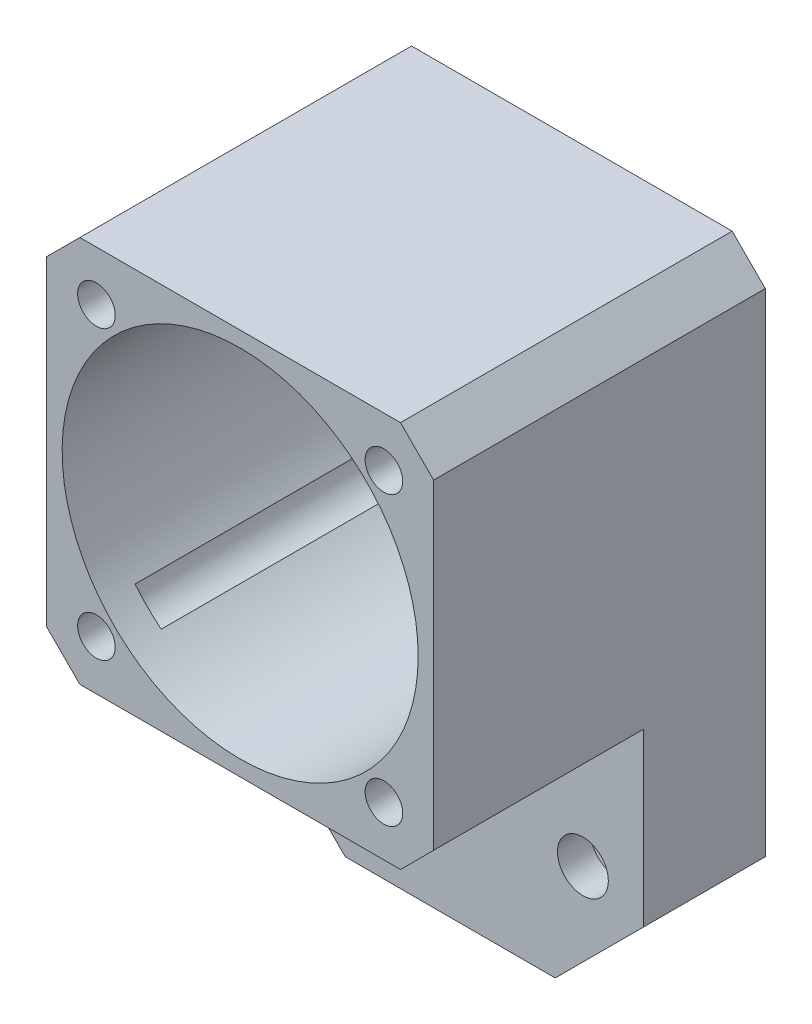
ISO-10303-21;
HEADER;
FILE_DESCRIPTION(('STEP AP214'),'2;1');
FILE_NAME('part.step','',(''),(''),'','','');
FILE_SCHEMA(('AUTOMOTIVE_DESIGN { 1 0 10303 214 1 1 1 1 }'));
ENDSEC;
DATA;
#1=APPLICATION_CONTEXT('core data for automotive mechanical design processes');
#2=APPLICATION_PROTOCOL_DEFINITION('international standard','automotive_design',2000,#1);
#3=PRODUCT_CONTEXT('',#1,'mechanical');
#4=PRODUCT('Part','Part','',(#3));
#5=PRODUCT_RELATED_PRODUCT_CATEGORY('part','',(#4));
#6=PRODUCT_DEFINITION_FORMATION('','',#4);
#7=PRODUCT_DEFINITION_CONTEXT('part definition',#1,'design');
#8=PRODUCT_DEFINITION('design','',#6,#7);
#9=PRODUCT_DEFINITION_SHAPE('','',#8);
#10=(LENGTH_UNIT() NAMED_UNIT(*) SI_UNIT(.MILLI.,.METRE.));
#11=(NAMED_UNIT(*) PLANE_ANGLE_UNIT() SI_UNIT($,.RADIAN.));
#12=(NAMED_UNIT(*) SI_UNIT($,.STERADIAN.) SOLID_ANGLE_UNIT());
#13=UNCERTAINTY_MEASURE_WITH_UNIT(LENGTH_MEASURE(1.E-05),#10,'distance_accuracy_value','');
#14=(GEOMETRIC_REPRESENTATION_CONTEXT(3) GLOBAL_UNCERTAINTY_ASSIGNED_CONTEXT((#13)) GLOBAL_UNIT_ASSIGNED_CONTEXT((#10,
#11,#12)) REPRESENTATION_CONTEXT('',''));
#15=CARTESIAN_POINT('',(0.,0.,0.));
#16=DIRECTION('',(0.,0.,1.));
#17=DIRECTION('',(1.,0.,0.));
#18=AXIS2_PLACEMENT_3D('',#15,#16,#17);
#19=CARTESIAN_POINT('',(0.,0.,11.));
#20=DIRECTION('',(0.,0.,-1.));
#21=DIRECTION('',(-1.,0.,0.));
#22=AXIS2_PLACEMENT_3D('',#19,#20,#21);
#23=CYLINDRICAL_SURFACE('',#22,16.1);
#24=CARTESIAN_POINT('',(0.,0.,30.));
#25=DIRECTION('',(0.,0.,1.));
#26=DIRECTION('',(1.,0.,0.));
#27=AXIS2_PLACEMENT_3D('',#24,#25,#26);
#28=CIRCLE('',#27,16.1);
#29=CARTESIAN_POINT('',(16.1,0.,30.));
#30=VERTEX_POINT('',#29);
#31=EDGE_CURVE('E253',#30,#30,#28,.T.);
#32=ORIENTED_EDGE('',*,*,#31,.T.);
#33=EDGE_LOOP('',(#32));
#34=FACE_BOUND('',#33,.T.);
#35=CARTESIAN_POINT('',(0.,0.,27.));
#36=DIRECTION('',(0.,0.,1.));
#37=DIRECTION('',(1.,0.,0.));
#38=AXIS2_PLACEMENT_3D('',#35,#36,#37);
#39=CIRCLE('',#38,16.1);
#40=CARTESIAN_POINT('',(12.5033010518266,10.1428527943273,27.));
#41=VERTEX_POINT('',#40);
#42=CARTESIAN_POINT('',(10.1428527943273,12.5033010518266,27.));
#43=VERTEX_POINT('',#42);
#44=EDGE_CURVE('E200',#41,#43,#39,.T.);
#45=ORIENTED_EDGE('',*,*,#44,.F.);
#46=DIRECTION('',(0.,0.,-1.));
#47=VECTOR('',#46,1.);
#48=CARTESIAN_POINT('',(12.5033010518266,10.1428527943273,13.5));
#49=LINE('',#48,#47);
#50=CARTESIAN_POINT('',(12.5033010518266,10.1428527943273,0.));
#51=VERTEX_POINT('',#50);
#52=EDGE_CURVE('E216',#41,#51,#49,.T.);
#53=ORIENTED_EDGE('',*,*,#52,.T.);
#54=CARTESIAN_POINT('',(0.,0.,0.));
#55=DIRECTION('',(0.,0.,1.));
#56=DIRECTION('',(1.,0.,0.));
#57=AXIS2_PLACEMENT_3D('',#54,#55,#56);
#58=CIRCLE('',#57,16.1);
#59=CARTESIAN_POINT('',(12.5033010518266,-10.1428527943273,0.));
#60=VERTEX_POINT('',#59);
#61=EDGE_CURVE('E199',#60,#51,#58,.T.);
#62=ORIENTED_EDGE('',*,*,#61,.F.);
#63=DIRECTION('',(0.,0.,-1.));
#64=VECTOR('',#63,1.);
#65=CARTESIAN_POINT('',(12.5033010518266,-10.1428527943273,13.5));
#66=LINE('',#65,#64);
#67=CARTESIAN_POINT('',(12.5033010518266,-10.1428527943273,27.));
#68=VERTEX_POINT('',#67);
#69=EDGE_CURVE('E189',#60,#68,#66,.F.);
#70=ORIENTED_EDGE('',*,*,#69,.T.);
#71=CARTESIAN_POINT('',(0.,0.,27.));
#72=DIRECTION('',(0.,0.,1.));
#73=DIRECTION('',(1.,0.,0.));
#74=AXIS2_PLACEMENT_3D('',#71,#72,#73);
#75=CIRCLE('',#74,16.1);
#76=CARTESIAN_POINT('',(10.1428527943273,-12.5033010518266,27.));
#77=VERTEX_POINT('',#76);
#78=EDGE_CURVE('E176',#77,#68,#75,.T.);
#79=ORIENTED_EDGE('',*,*,#78,.F.);
#80=DIRECTION('',(0.,0.,-1.));
#81=VECTOR('',#80,1.);
#82=CARTESIAN_POINT('',(10.1428527943273,-12.5033010518266,13.5));
#83=LINE('',#82,#81);
#84=CARTESIAN_POINT('',(10.1428527943273,-12.5033010518266,0.));
#85=VERTEX_POINT('',#84);
#86=EDGE_CURVE('E191',#77,#85,#83,.T.);
#87=ORIENTED_EDGE('',*,*,#86,.T.);
#88=CARTESIAN_POINT('',(-10.1428527943273,-12.5033010518266,0.));
#89=VERTEX_POINT('',#88);
#90=EDGE_CURVE('E282',#89,#85,#58,.T.);
#91=ORIENTED_EDGE('',*,*,#90,.F.);
#92=DIRECTION('',(0.,0.,-1.));
#93=VECTOR('',#92,1.);
#94=CARTESIAN_POINT('',(-10.1428527943273,-12.5033010518266,13.5));
#95=LINE('',#94,#93);
#96=CARTESIAN_POINT('',(-10.1428527943273,-12.5033010518266,27.));
#97=VERTEX_POINT('',#96);
#98=EDGE_CURVE('E202',#89,#97,#95,.F.);
#99=ORIENTED_EDGE('',*,*,#98,.T.);
#100=CARTESIAN_POINT('',(0.,0.,27.));
#101=DIRECTION('',(0.,0.,1.));
#102=DIRECTION('',(1.,0.,0.));
#103=AXIS2_PLACEMENT_3D('',#100,#101,#102);
#104=CIRCLE('',#103,16.1);
#105=CARTESIAN_POINT('',(-12.5033010518266,-10.1428527943273,27.));
#106=VERTEX_POINT('',#105);
#107=EDGE_CURVE('E316',#106,#97,#104,.T.);
#108=ORIENTED_EDGE('',*,*,#107,.F.);
#109=DIRECTION('',(0.,0.,-1.));
#110=VECTOR('',#109,1.);
#111=CARTESIAN_POINT('',(-12.5033010518266,-10.1428527943273,13.5));
#112=LINE('',#111,#110);
#113=CARTESIAN_POINT('',(-12.5033010518266,-10.1428527943273,0.));
#114=VERTEX_POINT('',#113);
#115=EDGE_CURVE('E210',#106,#114,#112,.T.);
#116=ORIENTED_EDGE('',*,*,#115,.T.);
#117=CARTESIAN_POINT('',(-12.5033010518266,10.1428527943273,0.));
#118=VERTEX_POINT('',#117);
#119=EDGE_CURVE('E278',#118,#114,#58,.T.);
#120=ORIENTED_EDGE('',*,*,#119,.F.);
#121=DIRECTION('',(0.,0.,-1.));
#122=VECTOR('',#121,1.);
#123=CARTESIAN_POINT('',(-12.5033010518266,10.1428527943273,13.5));
#124=LINE('',#123,#122);
#125=CARTESIAN_POINT('',(-12.5033010518266,10.1428527943273,27.));
#126=VERTEX_POINT('',#125);
#127=EDGE_CURVE('E290',#118,#126,#124,.F.);
#128=ORIENTED_EDGE('',*,*,#127,.T.);
#129=CARTESIAN_POINT('',(0.,0.,27.));
#130=DIRECTION('',(0.,0.,1.));
#131=DIRECTION('',(1.,0.,0.));
#132=AXIS2_PLACEMENT_3D('',#129,#130,#131);
#133=CIRCLE('',#132,16.1);
#134=CARTESIAN_POINT('',(-10.1428527943273,12.5033010518266,27.));
#135=VERTEX_POINT('',#134);
#136=EDGE_CURVE('E225',#135,#126,#133,.T.);
#137=ORIENTED_EDGE('',*,*,#136,.F.);
#138=DIRECTION('',(0.,0.,-1.));
#139=VECTOR('',#138,1.);
#140=CARTESIAN_POINT('',(-10.1428527943273,12.5033010518266,13.5));
#141=LINE('',#140,#139);
#142=CARTESIAN_POINT('',(-10.1428527943273,12.5033010518266,0.));
#143=VERTEX_POINT('',#142);
#144=EDGE_CURVE('E307',#135,#143,#141,.T.);
#145=ORIENTED_EDGE('',*,*,#144,.T.);
#146=CARTESIAN_POINT('',(10.1428527943273,12.5033010518266,0.));
#147=VERTEX_POINT('',#146);
#148=EDGE_CURVE('E277',#147,#143,#58,.T.);
#149=ORIENTED_EDGE('',*,*,#148,.F.);
#150=DIRECTION('',(0.,0.,-1.));
#151=VECTOR('',#150,1.);
#152=CARTESIAN_POINT('',(10.1428527943273,12.5033010518266,13.5));
#153=LINE('',#152,#151);
#154=EDGE_CURVE('E213',#147,#43,#153,.F.);
#155=ORIENTED_EDGE('',*,*,#154,.T.);
#156=EDGE_LOOP('',(#45,#53,#62,#70,#79,#87,#91,#99,#108,#116,#120,#128,#137,#145,#149,#155));
#157=FACE_BOUND('',#156,.T.);
#158=ADVANCED_FACE('F37',(#34,#157),#23,.F.);
#159=CARTESIAN_POINT('',(0.,0.,11.));
#160=DIRECTION('',(0.,0.,1.));
#161=DIRECTION('',(1.,0.,0.));
#162=AXIS2_PLACEMENT_3D('',#159,#160,#161);
#163=PLANE('',#162);
#164=DIRECTION('',(0.,-1.,0.));
#165=VECTOR('',#164,1.);
#166=CARTESIAN_POINT('',(-17.5,17.5,11.));
#167=LINE('',#166,#165);
#168=CARTESIAN_POINT('',(-17.5,-14.5,11.));
#169=VERTEX_POINT('',#168);
#170=CARTESIAN_POINT('',(-17.5,-30.,11.));
#171=VERTEX_POINT('',#170);
#172=EDGE_CURVE('E283',#169,#171,#167,.T.);
#173=ORIENTED_EDGE('',*,*,#172,.T.);
#174=DIRECTION('',(-0.707106781186546,0.707106781186549,0.));
#175=VECTOR('',#174,1.);
#176=CARTESIAN_POINT('',(-23.75,-23.7499999999999,11.));
#177=LINE('',#176,#175);
#178=CARTESIAN_POINT('',(-9.5,-38.,11.));
#179=VERTEX_POINT('',#178);
#180=EDGE_CURVE('E45',#171,#179,#177,.F.);
#181=ORIENTED_EDGE('',*,*,#180,.T.);
#182=DIRECTION('',(1.,0.,0.));
#183=VECTOR('',#182,1.);
#184=CARTESIAN_POINT('',(-17.5,-38.,11.));
#185=LINE('',#184,#183);
#186=CARTESIAN_POINT('',(9.49999999999998,-38.,11.));
#187=VERTEX_POINT('',#186);
#188=EDGE_CURVE('E285',#179,#187,#185,.T.);
#189=ORIENTED_EDGE('',*,*,#188,.T.);
#190=DIRECTION('',(-0.707106781186549,-0.707106781186546,0.));
#191=VECTOR('',#190,1.);
#192=CARTESIAN_POINT('',(23.75,-23.7500000000001,11.));
#193=LINE('',#192,#191);
#194=CARTESIAN_POINT('',(17.5,-30.,11.));
#195=VERTEX_POINT('',#194);
#196=EDGE_CURVE('E52',#187,#195,#193,.F.);
#197=ORIENTED_EDGE('',*,*,#196,.T.);
#198=DIRECTION('',(0.,1.,0.));
#199=VECTOR('',#198,1.);
#200=CARTESIAN_POINT('',(17.5,17.5,11.));
#201=LINE('',#200,#199);
#202=CARTESIAN_POINT('',(17.5,-14.5,11.));
#203=VERTEX_POINT('',#202);
#204=EDGE_CURVE('E288',#195,#203,#201,.T.);
#205=ORIENTED_EDGE('',*,*,#204,.T.);
#206=DIRECTION('',(0.707106781186549,0.707106781186546,0.));
#207=VECTOR('',#206,1.);
#208=CARTESIAN_POINT('',(17.5,-14.5,11.));
#209=LINE('',#208,#207);
#210=CARTESIAN_POINT('',(14.5,-17.5,11.));
#211=VERTEX_POINT('',#210);
#212=EDGE_CURVE('E354',#203,#211,#209,.F.);
#213=ORIENTED_EDGE('',*,*,#212,.T.);
#214=DIRECTION('',(1.,0.,0.));
#215=VECTOR('',#214,1.);
#216=CARTESIAN_POINT('',(-17.5,-17.5,11.));
#217=LINE('',#216,#215);
#218=CARTESIAN_POINT('',(-14.5,-17.5,11.));
#219=VERTEX_POINT('',#218);
#220=EDGE_CURVE('E256',#219,#211,#217,.T.);
#221=ORIENTED_EDGE('',*,*,#220,.F.);
#222=DIRECTION('',(0.707106781186546,-0.707106781186549,0.));
#223=VECTOR('',#222,1.);
#224=CARTESIAN_POINT('',(-14.5,-17.5,11.));
#225=LINE('',#224,#223);
#226=EDGE_CURVE('E351',#219,#169,#225,.F.);
#227=ORIENTED_EDGE('',*,*,#226,.T.);
#228=EDGE_LOOP('',(#173,#181,#189,#197,#205,#213,#221,#227));
#229=FACE_BOUND('',#228,.T.);
#230=CARTESIAN_POINT('',(-12.,-28.,11.));
#231=DIRECTION('',(0.,0.,1.));
#232=DIRECTION('',(1.,0.,0.));
#233=AXIS2_PLACEMENT_3D('',#230,#231,#232);
#234=CIRCLE('',#233,2.3);
#235=CARTESIAN_POINT('',(-9.7,-28.,11.));
#236=VERTEX_POINT('',#235);
#237=EDGE_CURVE('E274',#236,#236,#234,.T.);
#238=ORIENTED_EDGE('',*,*,#237,.F.);
#239=EDGE_LOOP('',(#238));
#240=FACE_BOUND('',#239,.T.);
#241=CARTESIAN_POINT('',(12.,-28.,11.));
#242=DIRECTION('',(0.,0.,1.));
#243=DIRECTION('',(1.,0.,0.));
#244=AXIS2_PLACEMENT_3D('',#241,#242,#243);
#245=CIRCLE('',#244,2.3);
#246=CARTESIAN_POINT('',(14.3,-28.,11.));
#247=VERTEX_POINT('',#246);
#248=EDGE_CURVE('E269',#247,#247,#245,.T.);
#249=ORIENTED_EDGE('',*,*,#248,.F.);
#250=EDGE_LOOP('',(#249));
#251=FACE_BOUND('',#250,.T.);
#252=ADVANCED_FACE('F368',(#229,#240,#251),#163,.T.);
#253=CARTESIAN_POINT('',(0.,0.,0.));
#254=DIRECTION('',(0.,0.,1.));
#255=DIRECTION('',(1.,0.,0.));
#256=AXIS2_PLACEMENT_3D('',#253,#254,#255);
#257=PLANE('',#256);
#258=CARTESIAN_POINT('',(13.,13.,0.));
#259=DIRECTION('',(0.,0.,1.));
#260=DIRECTION('',(1.,0.,0.));
#261=AXIS2_PLACEMENT_3D('',#258,#259,#260);
#262=CIRCLE('',#261,2.9);
#263=EDGE_CURVE('E760',#51,#147,#262,.T.);
#264=ORIENTED_EDGE('',*,*,#263,.T.);
#265=ORIENTED_EDGE('',*,*,#148,.T.);
#266=CARTESIAN_POINT('',(-13.,13.,0.));
#267=DIRECTION('',(0.,0.,1.));
#268=DIRECTION('',(1.,0.,0.));
#269=AXIS2_PLACEMENT_3D('',#266,#267,#268);
#270=CIRCLE('',#269,2.9);
#271=EDGE_CURVE('E218',#143,#118,#270,.T.);
#272=ORIENTED_EDGE('',*,*,#271,.T.);
#273=ORIENTED_EDGE('',*,*,#119,.T.);
#274=CARTESIAN_POINT('',(-13.,-13.,0.));
#275=DIRECTION('',(0.,0.,1.));
#276=DIRECTION('',(1.,0.,0.));
#277=AXIS2_PLACEMENT_3D('',#274,#275,#276);
#278=CIRCLE('',#277,2.9);
#279=EDGE_CURVE('E192',#114,#89,#278,.T.);
#280=ORIENTED_EDGE('',*,*,#279,.T.);
#281=ORIENTED_EDGE('',*,*,#90,.T.);
#282=CARTESIAN_POINT('',(13.,-13.,0.));
#283=DIRECTION('',(0.,0.,1.));
#284=DIRECTION('',(1.,0.,0.));
#285=AXIS2_PLACEMENT_3D('',#282,#283,#284);
#286=CIRCLE('',#285,2.9);
#287=EDGE_CURVE('E193',#85,#60,#286,.T.);
#288=ORIENTED_EDGE('',*,*,#287,.T.);
#289=ORIENTED_EDGE('',*,*,#61,.T.);
#290=EDGE_LOOP('',(#264,#265,#272,#273,#280,#281,#288,#289));
#291=FACE_BOUND('',#290,.T.);
#292=CARTESIAN_POINT('',(12.,-28.,0.));
#293=DIRECTION('',(0.,0.,1.));
#294=DIRECTION('',(1.,0.,0.));
#295=AXIS2_PLACEMENT_3D('',#292,#293,#294);
#296=CIRCLE('',#295,4.);
#297=CARTESIAN_POINT('',(16.,-28.,0.));
#298=VERTEX_POINT('',#297);
#299=EDGE_CURVE('E227',#298,#298,#296,.T.);
#300=ORIENTED_EDGE('',*,*,#299,.T.);
#301=EDGE_LOOP('',(#300));
#302=FACE_BOUND('',#301,.T.);
#303=CARTESIAN_POINT('',(-12.,-28.,0.));
#304=DIRECTION('',(0.,0.,1.));
#305=DIRECTION('',(1.,0.,0.));
#306=AXIS2_PLACEMENT_3D('',#303,#304,#305);
#307=CIRCLE('',#306,4.);
#308=CARTESIAN_POINT('',(-8.,-28.,0.));
#309=VERTEX_POINT('',#308);
#310=EDGE_CURVE('E234',#309,#309,#307,.T.);
#311=ORIENTED_EDGE('',*,*,#310,.T.);
#312=EDGE_LOOP('',(#311));
#313=FACE_BOUND('',#312,.T.);
#314=DIRECTION('',(1.,0.,0.));
#315=VECTOR('',#314,1.);
#316=CARTESIAN_POINT('',(-17.5,-38.,0.));
#317=LINE('',#316,#315);
#318=CARTESIAN_POINT('',(-9.5,-38.,0.));
#319=VERTEX_POINT('',#318);
#320=CARTESIAN_POINT('',(9.49999999999998,-38.,0.));
#321=VERTEX_POINT('',#320);
#322=EDGE_CURVE('E292',#319,#321,#317,.T.);
#323=ORIENTED_EDGE('',*,*,#322,.F.);
#324=DIRECTION('',(0.707106781186546,-0.707106781186549,0.));
#325=VECTOR('',#324,1.);
#326=CARTESIAN_POINT('',(-9.5,-38.,0.));
#327=LINE('',#326,#325);
#328=CARTESIAN_POINT('',(-17.5,-30.,0.));
#329=VERTEX_POINT('',#328);
#330=EDGE_CURVE('E363',#319,#329,#327,.F.);
#331=ORIENTED_EDGE('',*,*,#330,.T.);
#332=DIRECTION('',(0.,-1.,0.));
#333=VECTOR('',#332,1.);
#334=CARTESIAN_POINT('',(-17.5,17.5,0.));
#335=LINE('',#334,#333);
#336=CARTESIAN_POINT('',(-17.5,14.5,0.));
#337=VERTEX_POINT('',#336);
#338=EDGE_CURVE('E281',#337,#329,#335,.T.);
#339=ORIENTED_EDGE('',*,*,#338,.F.);
#340=DIRECTION('',(-0.707106781186549,-0.707106781186546,0.));
#341=VECTOR('',#340,1.);
#342=CARTESIAN_POINT('',(-17.5,14.5,0.));
#343=LINE('',#342,#341);
#344=CARTESIAN_POINT('',(-14.5,17.5,0.));
#345=VERTEX_POINT('',#344);
#346=EDGE_CURVE('E339',#337,#345,#343,.F.);
#347=ORIENTED_EDGE('',*,*,#346,.T.);
#348=DIRECTION('',(-1.,0.,0.));
#349=VECTOR('',#348,1.);
#350=CARTESIAN_POINT('',(-17.5,17.5,0.));
#351=LINE('',#350,#349);
#352=CARTESIAN_POINT('',(14.5,17.5,0.));
#353=VERTEX_POINT('',#352);
#354=EDGE_CURVE('E286',#353,#345,#351,.T.);
#355=ORIENTED_EDGE('',*,*,#354,.F.);
#356=DIRECTION('',(-0.707106781186547,0.707106781186548,0.));
#357=VECTOR('',#356,1.);
#358=CARTESIAN_POINT('',(14.5,17.5,0.));
#359=LINE('',#358,#357);
#360=CARTESIAN_POINT('',(17.5,14.5,0.));
#361=VERTEX_POINT('',#360);
#362=EDGE_CURVE('E336',#353,#361,#359,.F.);
#363=ORIENTED_EDGE('',*,*,#362,.T.);
#364=DIRECTION('',(0.,1.,0.));
#365=VECTOR('',#364,1.);
#366=CARTESIAN_POINT('',(17.5,17.5,0.));
#367=LINE('',#366,#365);
#368=CARTESIAN_POINT('',(17.5,-30.,0.));
#369=VERTEX_POINT('',#368);
#370=EDGE_CURVE('E295',#369,#361,#367,.T.);
#371=ORIENTED_EDGE('',*,*,#370,.F.);
#372=DIRECTION('',(0.707106781186549,0.707106781186546,0.));
#373=VECTOR('',#372,1.);
#374=CARTESIAN_POINT('',(17.5,-30.,0.));
#375=LINE('',#374,#373);
#376=EDGE_CURVE('E361',#369,#321,#375,.F.);
#377=ORIENTED_EDGE('',*,*,#376,.T.);
#378=EDGE_LOOP('',(#323,#331,#339,#347,#355,#363,#371,#377));
#379=FACE_BOUND('',#378,.T.);
#380=ADVANCED_FACE('F379',(#291,#302,#313,#379),#257,.F.);
#381=CARTESIAN_POINT('',(-17.5,17.5,11.));
#382=DIRECTION('',(1.,0.,0.));
#383=DIRECTION('',(0.,1.,0.));
#384=AXIS2_PLACEMENT_3D('',#381,#382,#383);
#385=PLANE('',#384);
#386=ORIENTED_EDGE('',*,*,#338,.T.);
#387=DIRECTION('',(0.,0.,1.));
#388=VECTOR('',#387,1.);
#389=CARTESIAN_POINT('',(-17.5,-30.,11.));
#390=LINE('',#389,#388);
#391=EDGE_CURVE('E60',#329,#171,#390,.T.);
#392=ORIENTED_EDGE('',*,*,#391,.T.);
#393=ORIENTED_EDGE('',*,*,#172,.F.);
#394=DIRECTION('',(0.,0.,1.));
#395=VECTOR('',#394,1.);
#396=CARTESIAN_POINT('',(-17.5,-14.5,11.));
#397=LINE('',#396,#395);
#398=CARTESIAN_POINT('',(-17.5,-14.5,30.));
#399=VERTEX_POINT('',#398);
#400=EDGE_CURVE('E326',#169,#399,#397,.T.);
#401=ORIENTED_EDGE('',*,*,#400,.T.);
#402=DIRECTION('',(0.,-1.,0.));
#403=VECTOR('',#402,1.);
#404=CARTESIAN_POINT('',(-17.5,17.5,30.));
#405=LINE('',#404,#403);
#406=CARTESIAN_POINT('',(-17.5,14.5,30.));
#407=VERTEX_POINT('',#406);
#408=EDGE_CURVE('E257',#407,#399,#405,.T.);
#409=ORIENTED_EDGE('',*,*,#408,.F.);
#410=DIRECTION('',(0.,0.,-1.));
#411=VECTOR('',#410,1.);
#412=CARTESIAN_POINT('',(-17.5,14.5,11.));
#413=LINE('',#412,#411);
#414=EDGE_CURVE('E323',#407,#337,#413,.T.);
#415=ORIENTED_EDGE('',*,*,#414,.T.);
#416=EDGE_LOOP('',(#386,#392,#393,#401,#409,#415));
#417=FACE_BOUND('',#416,.T.);
#418=ADVANCED_FACE('F380',(#417),#385,.F.);
#419=CARTESIAN_POINT('',(-17.5,-38.,11.));
#420=DIRECTION('',(0.,1.,0.));
#421=DIRECTION('',(0.,0.,1.));
#422=AXIS2_PLACEMENT_3D('',#419,#420,#421);
#423=PLANE('',#422);
#424=ORIENTED_EDGE('',*,*,#188,.F.);
#425=DIRECTION('',(0.,0.,-1.));
#426=VECTOR('',#425,1.);
#427=CARTESIAN_POINT('',(-9.5,-38.,11.));
#428=LINE('',#427,#426);
#429=EDGE_CURVE('E358',#179,#319,#428,.T.);
#430=ORIENTED_EDGE('',*,*,#429,.T.);
#431=ORIENTED_EDGE('',*,*,#322,.T.);
#432=DIRECTION('',(0.,0.,1.));
#433=VECTOR('',#432,1.);
#434=CARTESIAN_POINT('',(9.49999999999998,-38.,11.));
#435=LINE('',#434,#433);
#436=EDGE_CURVE('E356',#321,#187,#435,.T.);
#437=ORIENTED_EDGE('',*,*,#436,.T.);
#438=EDGE_LOOP('',(#424,#430,#431,#437));
#439=FACE_BOUND('',#438,.T.);
#440=ADVANCED_FACE('F373',(#439),#423,.F.);
#441=CARTESIAN_POINT('',(17.5,17.5,11.));
#442=DIRECTION('',(-1.,0.,0.));
#443=DIRECTION('',(0.,-1.,0.));
#444=AXIS2_PLACEMENT_3D('',#441,#442,#443);
#445=PLANE('',#444);
#446=ORIENTED_EDGE('',*,*,#204,.F.);
#447=DIRECTION('',(0.,0.,-1.));
#448=VECTOR('',#447,1.);
#449=CARTESIAN_POINT('',(17.5,-30.,11.));
#450=LINE('',#449,#448);
#451=EDGE_CURVE('E12',#195,#369,#450,.T.);
#452=ORIENTED_EDGE('',*,*,#451,.T.);
#453=ORIENTED_EDGE('',*,*,#370,.T.);
#454=DIRECTION('',(0.,0.,1.));
#455=VECTOR('',#454,1.);
#456=CARTESIAN_POINT('',(17.5,14.5,11.));
#457=LINE('',#456,#455);
#458=CARTESIAN_POINT('',(17.5,14.5,30.));
#459=VERTEX_POINT('',#458);
#460=EDGE_CURVE('E346',#361,#459,#457,.T.);
#461=ORIENTED_EDGE('',*,*,#460,.T.);
#462=DIRECTION('',(0.,1.,0.));
#463=VECTOR('',#462,1.);
#464=CARTESIAN_POINT('',(17.5,17.5,30.));
#465=LINE('',#464,#463);
#466=CARTESIAN_POINT('',(17.5,-14.5,30.));
#467=VERTEX_POINT('',#466);
#468=EDGE_CURVE('E263',#467,#459,#465,.T.);
#469=ORIENTED_EDGE('',*,*,#468,.F.);
#470=DIRECTION('',(0.,0.,-1.));
#471=VECTOR('',#470,1.);
#472=CARTESIAN_POINT('',(17.5,-14.5,11.));
#473=LINE('',#472,#471);
#474=EDGE_CURVE('E348',#467,#203,#473,.T.);
#475=ORIENTED_EDGE('',*,*,#474,.T.);
#476=EDGE_LOOP('',(#446,#452,#453,#461,#469,#475));
#477=FACE_BOUND('',#476,.T.);
#478=ADVANCED_FACE('F398',(#477),#445,.F.);
#479=CARTESIAN_POINT('',(-17.5,17.5,11.));
#480=DIRECTION('',(0.,-1.,0.));
#481=DIRECTION('',(0.,0.,-1.));
#482=AXIS2_PLACEMENT_3D('',#479,#480,#481);
#483=PLANE('',#482);
#484=ORIENTED_EDGE('',*,*,#354,.T.);
#485=DIRECTION('',(0.,0.,1.));
#486=VECTOR('',#485,1.);
#487=CARTESIAN_POINT('',(-14.5,17.5,11.));
#488=LINE('',#487,#486);
#489=CARTESIAN_POINT('',(-14.5,17.5,30.));
#490=VERTEX_POINT('',#489);
#491=EDGE_CURVE('E344',#345,#490,#488,.T.);
#492=ORIENTED_EDGE('',*,*,#491,.T.);
#493=DIRECTION('',(-1.,0.,0.));
#494=VECTOR('',#493,1.);
#495=CARTESIAN_POINT('',(-17.5,17.5,30.));
#496=LINE('',#495,#494);
#497=CARTESIAN_POINT('',(14.5,17.5,30.));
#498=VERTEX_POINT('',#497);
#499=EDGE_CURVE('E266',#498,#490,#496,.T.);
#500=ORIENTED_EDGE('',*,*,#499,.F.);
#501=DIRECTION('',(0.,0.,-1.));
#502=VECTOR('',#501,1.);
#503=CARTESIAN_POINT('',(14.5,17.5,11.));
#504=LINE('',#503,#502);
#505=EDGE_CURVE('E341',#498,#353,#504,.T.);
#506=ORIENTED_EDGE('',*,*,#505,.T.);
#507=EDGE_LOOP('',(#484,#492,#500,#506));
#508=FACE_BOUND('',#507,.T.);
#509=ADVANCED_FACE('F389',(#508),#483,.F.);
#510=CARTESIAN_POINT('',(-13.,13.,11.));
#511=DIRECTION('',(0.,0.,-1.));
#512=DIRECTION('',(-1.,0.,0.));
#513=AXIS2_PLACEMENT_3D('',#510,#511,#512);
#514=CYLINDRICAL_SURFACE('',#513,1.7);
#515=CARTESIAN_POINT('',(-13.,13.,27.));
#516=DIRECTION('',(0.,0.,1.));
#517=DIRECTION('',(1.,0.,0.));
#518=AXIS2_PLACEMENT_3D('',#515,#516,#517);
#519=CIRCLE('',#518,1.7);
#520=CARTESIAN_POINT('',(-11.3,13.,27.));
#521=VERTEX_POINT('',#520);
#522=EDGE_CURVE('E224',#521,#521,#519,.T.);
#523=ORIENTED_EDGE('',*,*,#522,.F.);
#524=EDGE_LOOP('',(#523));
#525=FACE_BOUND('',#524,.T.);
#526=CARTESIAN_POINT('',(-13.,13.,30.));
#527=DIRECTION('',(0.,0.,1.));
#528=DIRECTION('',(1.,0.,0.));
#529=AXIS2_PLACEMENT_3D('',#526,#527,#528);
#530=CIRCLE('',#529,1.7);
#531=CARTESIAN_POINT('',(-11.3,13.,30.));
#532=VERTEX_POINT('',#531);
#533=EDGE_CURVE('E241',#532,#532,#530,.T.);
#534=ORIENTED_EDGE('',*,*,#533,.T.);
#535=EDGE_LOOP('',(#534));
#536=FACE_BOUND('',#535,.T.);
#537=ADVANCED_FACE('F414',(#525,#536),#514,.F.);
#538=CARTESIAN_POINT('',(13.,13.,11.));
#539=DIRECTION('',(0.,0.,-1.));
#540=DIRECTION('',(-1.,0.,0.));
#541=AXIS2_PLACEMENT_3D('',#538,#539,#540);
#542=CYLINDRICAL_SURFACE('',#541,1.7);
#543=CARTESIAN_POINT('',(13.,13.,27.));
#544=DIRECTION('',(0.,0.,1.));
#545=DIRECTION('',(1.,0.,0.));
#546=AXIS2_PLACEMENT_3D('',#543,#544,#545);
#547=CIRCLE('',#546,1.7);
#548=CARTESIAN_POINT('',(14.7,13.,27.));
#549=VERTEX_POINT('',#548);
#550=EDGE_CURVE('E204',#549,#549,#547,.T.);
#551=ORIENTED_EDGE('',*,*,#550,.F.);
#552=EDGE_LOOP('',(#551));
#553=FACE_BOUND('',#552,.T.);
#554=CARTESIAN_POINT('',(13.,13.,30.));
#555=DIRECTION('',(0.,0.,1.));
#556=DIRECTION('',(1.,0.,0.));
#557=AXIS2_PLACEMENT_3D('',#554,#555,#556);
#558=CIRCLE('',#557,1.7);
#559=CARTESIAN_POINT('',(14.7,13.,30.));
#560=VERTEX_POINT('',#559);
#561=EDGE_CURVE('E250',#560,#560,#558,.T.);
#562=ORIENTED_EDGE('',*,*,#561,.T.);
#563=EDGE_LOOP('',(#562));
#564=FACE_BOUND('',#563,.T.);
#565=ADVANCED_FACE('F530',(#553,#564),#542,.F.);
#566=CARTESIAN_POINT('',(-13.,-13.,11.));
#567=DIRECTION('',(0.,0.,-1.));
#568=DIRECTION('',(-1.,0.,0.));
#569=AXIS2_PLACEMENT_3D('',#566,#567,#568);
#570=CYLINDRICAL_SURFACE('',#569,1.7);
#571=CARTESIAN_POINT('',(-13.,-13.,27.));
#572=DIRECTION('',(0.,0.,1.));
#573=DIRECTION('',(1.,0.,0.));
#574=AXIS2_PLACEMENT_3D('',#571,#572,#573);
#575=CIRCLE('',#574,1.7);
#576=CARTESIAN_POINT('',(-11.3,-13.,27.));
#577=VERTEX_POINT('',#576);
#578=EDGE_CURVE('E184',#577,#577,#575,.T.);
#579=ORIENTED_EDGE('',*,*,#578,.F.);
#580=EDGE_LOOP('',(#579));
#581=FACE_BOUND('',#580,.T.);
#582=CARTESIAN_POINT('',(-13.,-13.,30.));
#583=DIRECTION('',(0.,0.,1.));
#584=DIRECTION('',(1.,0.,0.));
#585=AXIS2_PLACEMENT_3D('',#582,#583,#584);
#586=CIRCLE('',#585,1.7);
#587=CARTESIAN_POINT('',(-11.3,-13.,30.));
#588=VERTEX_POINT('',#587);
#589=EDGE_CURVE('E244',#588,#588,#586,.T.);
#590=ORIENTED_EDGE('',*,*,#589,.T.);
#591=EDGE_LOOP('',(#590));
#592=FACE_BOUND('',#591,.T.);
#593=ADVANCED_FACE('F518',(#581,#592),#570,.F.);
#594=CARTESIAN_POINT('',(13.,-13.,11.));
#595=DIRECTION('',(0.,0.,-1.));
#596=DIRECTION('',(-1.,0.,0.));
#597=AXIS2_PLACEMENT_3D('',#594,#595,#596);
#598=CYLINDRICAL_SURFACE('',#597,1.7);
#599=CARTESIAN_POINT('',(13.,-13.,27.));
#600=DIRECTION('',(0.,0.,1.));
#601=DIRECTION('',(1.,0.,0.));
#602=AXIS2_PLACEMENT_3D('',#599,#600,#601);
#603=CIRCLE('',#602,1.7);
#604=CARTESIAN_POINT('',(14.7,-13.,27.));
#605=VERTEX_POINT('',#604);
#606=EDGE_CURVE('E185',#605,#605,#603,.T.);
#607=ORIENTED_EDGE('',*,*,#606,.F.);
#608=EDGE_LOOP('',(#607));
#609=FACE_BOUND('',#608,.T.);
#610=CARTESIAN_POINT('',(13.,-13.,30.));
#611=DIRECTION('',(0.,0.,1.));
#612=DIRECTION('',(1.,0.,0.));
#613=AXIS2_PLACEMENT_3D('',#610,#611,#612);
#614=CIRCLE('',#613,1.7);
#615=CARTESIAN_POINT('',(14.7,-13.,30.));
#616=VERTEX_POINT('',#615);
#617=EDGE_CURVE('E247',#616,#616,#614,.T.);
#618=ORIENTED_EDGE('',*,*,#617,.T.);
#619=EDGE_LOOP('',(#618));
#620=FACE_BOUND('',#619,.T.);
#621=ADVANCED_FACE('F509',(#609,#620),#598,.F.);
#622=CARTESIAN_POINT('',(-12.,-28.,11.));
#623=DIRECTION('',(0.,0.,-1.));
#624=DIRECTION('',(-1.,0.,0.));
#625=AXIS2_PLACEMENT_3D('',#622,#623,#624);
#626=CYLINDRICAL_SURFACE('',#625,2.3);
#627=CARTESIAN_POINT('',(-12.,-28.,8.));
#628=DIRECTION('',(0.,0.,1.));
#629=DIRECTION('',(1.,0.,0.));
#630=AXIS2_PLACEMENT_3D('',#627,#628,#629);
#631=CIRCLE('',#630,2.3);
#632=CARTESIAN_POINT('',(-9.7,-28.,8.));
#633=VERTEX_POINT('',#632);
#634=EDGE_CURVE('E240',#633,#633,#631,.T.);
#635=ORIENTED_EDGE('',*,*,#634,.F.);
#636=EDGE_LOOP('',(#635));
#637=FACE_BOUND('',#636,.T.);
#638=ORIENTED_EDGE('',*,*,#237,.T.);
#639=EDGE_LOOP('',(#638));
#640=FACE_BOUND('',#639,.T.);
#641=ADVANCED_FACE('F499',(#637,#640),#626,.F.);
#642=CARTESIAN_POINT('',(12.,-28.,11.));
#643=DIRECTION('',(0.,0.,-1.));
#644=DIRECTION('',(-1.,0.,0.));
#645=AXIS2_PLACEMENT_3D('',#642,#643,#644);
#646=CYLINDRICAL_SURFACE('',#645,2.3);
#647=CARTESIAN_POINT('',(12.,-28.,8.));
#648=DIRECTION('',(0.,0.,1.));
#649=DIRECTION('',(1.,0.,0.));
#650=AXIS2_PLACEMENT_3D('',#647,#648,#649);
#651=CIRCLE('',#650,2.3);
#652=CARTESIAN_POINT('',(14.3,-28.,8.));
#653=VERTEX_POINT('',#652);
#654=EDGE_CURVE('E233',#653,#653,#651,.T.);
#655=ORIENTED_EDGE('',*,*,#654,.F.);
#656=EDGE_LOOP('',(#655));
#657=FACE_BOUND('',#656,.T.);
#658=ORIENTED_EDGE('',*,*,#248,.T.);
#659=EDGE_LOOP('',(#658));
#660=FACE_BOUND('',#659,.T.);
#661=ADVANCED_FACE('F492',(#657,#660),#646,.F.);
#662=CARTESIAN_POINT('',(0.,0.,30.));
#663=DIRECTION('',(0.,0.,1.));
#664=DIRECTION('',(1.,0.,0.));
#665=AXIS2_PLACEMENT_3D('',#662,#663,#664);
#666=PLANE('',#665);
#667=ORIENTED_EDGE('',*,*,#589,.F.);
#668=EDGE_LOOP('',(#667));
#669=FACE_BOUND('',#668,.T.);
#670=ORIENTED_EDGE('',*,*,#561,.F.);
#671=EDGE_LOOP('',(#670));
#672=FACE_BOUND('',#671,.T.);
#673=ORIENTED_EDGE('',*,*,#408,.T.);
#674=DIRECTION('',(-0.707106781186546,0.707106781186549,0.));
#675=VECTOR('',#674,1.);
#676=CARTESIAN_POINT('',(-16.,-16.,30.));
#677=LINE('',#676,#675);
#678=CARTESIAN_POINT('',(-14.5,-17.5,30.));
#679=VERTEX_POINT('',#678);
#680=EDGE_CURVE('E334',#399,#679,#677,.F.);
#681=ORIENTED_EDGE('',*,*,#680,.T.);
#682=DIRECTION('',(1.,0.,0.));
#683=VECTOR('',#682,1.);
#684=CARTESIAN_POINT('',(-17.5,-17.5,30.));
#685=LINE('',#684,#683);
#686=CARTESIAN_POINT('',(14.5,-17.5,30.));
#687=VERTEX_POINT('',#686);
#688=EDGE_CURVE('E260',#679,#687,#685,.T.);
#689=ORIENTED_EDGE('',*,*,#688,.T.);
#690=DIRECTION('',(-0.707106781186549,-0.707106781186546,0.));
#691=VECTOR('',#690,1.);
#692=CARTESIAN_POINT('',(16.,-16.0000000000001,30.));
#693=LINE('',#692,#691);
#694=EDGE_CURVE('E330',#687,#467,#693,.F.);
#695=ORIENTED_EDGE('',*,*,#694,.T.);
#696=ORIENTED_EDGE('',*,*,#468,.T.);
#697=DIRECTION('',(0.707106781186547,-0.707106781186548,0.));
#698=VECTOR('',#697,1.);
#699=CARTESIAN_POINT('',(16.,16.,30.));
#700=LINE('',#699,#698);
#701=EDGE_CURVE('E328',#459,#498,#700,.F.);
#702=ORIENTED_EDGE('',*,*,#701,.T.);
#703=ORIENTED_EDGE('',*,*,#499,.T.);
#704=DIRECTION('',(0.707106781186549,0.707106781186546,0.));
#705=VECTOR('',#704,1.);
#706=CARTESIAN_POINT('',(-16.,16.,30.));
#707=LINE('',#706,#705);
#708=EDGE_CURVE('E332',#490,#407,#707,.F.);
#709=ORIENTED_EDGE('',*,*,#708,.T.);
#710=EDGE_LOOP('',(#673,#681,#689,#695,#696,#702,#703,#709));
#711=FACE_BOUND('',#710,.T.);
#712=ORIENTED_EDGE('',*,*,#31,.F.);
#713=EDGE_LOOP('',(#712));
#714=FACE_BOUND('',#713,.T.);
#715=ORIENTED_EDGE('',*,*,#617,.F.);
#716=EDGE_LOOP('',(#715));
#717=FACE_BOUND('',#716,.T.);
#718=ORIENTED_EDGE('',*,*,#533,.F.);
#719=EDGE_LOOP('',(#718));
#720=FACE_BOUND('',#719,.T.);
#721=ADVANCED_FACE('F498',(#669,#672,#711,#714,#717,#720),#666,.T.);
#722=CARTESIAN_POINT('',(-17.5,-17.5,30.));
#723=DIRECTION('',(0.,1.,0.));
#724=DIRECTION('',(0.,0.,1.));
#725=AXIS2_PLACEMENT_3D('',#722,#723,#724);
#726=PLANE('',#725);
#727=ORIENTED_EDGE('',*,*,#688,.F.);
#728=DIRECTION('',(0.,0.,-1.));
#729=VECTOR('',#728,1.);
#730=CARTESIAN_POINT('',(-14.5,-17.5,30.));
#731=LINE('',#730,#729);
#732=EDGE_CURVE('E320',#679,#219,#731,.T.);
#733=ORIENTED_EDGE('',*,*,#732,.T.);
#734=ORIENTED_EDGE('',*,*,#220,.T.);
#735=DIRECTION('',(0.,0.,1.));
#736=VECTOR('',#735,1.);
#737=CARTESIAN_POINT('',(14.5,-17.5,30.));
#738=LINE('',#737,#736);
#739=EDGE_CURVE('E310',#211,#687,#738,.T.);
#740=ORIENTED_EDGE('',*,*,#739,.T.);
#741=EDGE_LOOP('',(#727,#733,#734,#740));
#742=FACE_BOUND('',#741,.T.);
#743=ADVANCED_FACE('F572',(#742),#726,.F.);
#744=CARTESIAN_POINT('',(-12.,-28.,22.3137084989848));
#745=DIRECTION('',(0.,0.,-1.));
#746=DIRECTION('',(-1.,0.,0.));
#747=AXIS2_PLACEMENT_3D('',#744,#745,#746);
#748=CYLINDRICAL_SURFACE('',#747,4.);
#749=ORIENTED_EDGE('',*,*,#310,.F.);
#750=EDGE_LOOP('',(#749));
#751=FACE_BOUND('',#750,.T.);
#752=CARTESIAN_POINT('',(-12.,-28.,8.));
#753=DIRECTION('',(0.,0.,1.));
#754=DIRECTION('',(1.,0.,0.));
#755=AXIS2_PLACEMENT_3D('',#752,#753,#754);
#756=CIRCLE('',#755,4.);
#757=CARTESIAN_POINT('',(-8.,-28.,8.));
#758=VERTEX_POINT('',#757);
#759=EDGE_CURVE('E237',#758,#758,#756,.T.);
#760=ORIENTED_EDGE('',*,*,#759,.T.);
#761=EDGE_LOOP('',(#760));
#762=FACE_BOUND('',#761,.T.);
#763=ADVANCED_FACE('F582',(#751,#762),#748,.F.);
#764=CARTESIAN_POINT('',(0.,0.,8.));
#765=DIRECTION('',(0.,0.,1.));
#766=DIRECTION('',(1.,0.,0.));
#767=AXIS2_PLACEMENT_3D('',#764,#765,#766);
#768=PLANE('',#767);
#769=ORIENTED_EDGE('',*,*,#634,.T.);
#770=EDGE_LOOP('',(#769));
#771=FACE_BOUND('',#770,.T.);
#772=ORIENTED_EDGE('',*,*,#759,.F.);
#773=EDGE_LOOP('',(#772));
#774=FACE_BOUND('',#773,.T.);
#775=ADVANCED_FACE('F674',(#771,#774),#768,.F.);
#776=CARTESIAN_POINT('',(12.,-28.,22.3137084989848));
#777=DIRECTION('',(0.,0.,-1.));
#778=DIRECTION('',(-1.,0.,0.));
#779=AXIS2_PLACEMENT_3D('',#776,#777,#778);
#780=CYLINDRICAL_SURFACE('',#779,4.);
#781=ORIENTED_EDGE('',*,*,#299,.F.);
#782=EDGE_LOOP('',(#781));
#783=FACE_BOUND('',#782,.T.);
#784=CARTESIAN_POINT('',(12.,-28.,8.));
#785=DIRECTION('',(0.,0.,1.));
#786=DIRECTION('',(1.,0.,0.));
#787=AXIS2_PLACEMENT_3D('',#784,#785,#786);
#788=CIRCLE('',#787,4.);
#789=CARTESIAN_POINT('',(16.,-28.,8.));
#790=VERTEX_POINT('',#789);
#791=EDGE_CURVE('E230',#790,#790,#788,.T.);
#792=ORIENTED_EDGE('',*,*,#791,.T.);
#793=EDGE_LOOP('',(#792));
#794=FACE_BOUND('',#793,.T.);
#795=ADVANCED_FACE('F666',(#783,#794),#780,.F.);
#796=CARTESIAN_POINT('',(0.,0.,8.));
#797=DIRECTION('',(0.,0.,1.));
#798=DIRECTION('',(1.,0.,0.));
#799=AXIS2_PLACEMENT_3D('',#796,#797,#798);
#800=PLANE('',#799);
#801=ORIENTED_EDGE('',*,*,#654,.T.);
#802=EDGE_LOOP('',(#801));
#803=FACE_BOUND('',#802,.T.);
#804=ORIENTED_EDGE('',*,*,#791,.F.);
#805=EDGE_LOOP('',(#804));
#806=FACE_BOUND('',#805,.T.);
#807=ADVANCED_FACE('F658',(#803,#806),#800,.F.);
#808=CARTESIAN_POINT('',(-13.,13.,38.202438661764));
#809=DIRECTION('',(0.,0.,-1.));
#810=DIRECTION('',(-1.,0.,0.));
#811=AXIS2_PLACEMENT_3D('',#808,#809,#810);
#812=CYLINDRICAL_SURFACE('',#811,2.9);
#813=CARTESIAN_POINT('',(-13.,13.,27.));
#814=DIRECTION('',(0.,0.,1.));
#815=DIRECTION('',(1.,0.,0.));
#816=AXIS2_PLACEMENT_3D('',#813,#814,#815);
#817=CIRCLE('',#816,2.9);
#818=EDGE_CURVE('E221',#135,#126,#817,.T.);
#819=ORIENTED_EDGE('',*,*,#818,.T.);
#820=ORIENTED_EDGE('',*,*,#127,.F.);
#821=ORIENTED_EDGE('',*,*,#271,.F.);
#822=ORIENTED_EDGE('',*,*,#144,.F.);
#823=EDGE_LOOP('',(#819,#820,#821,#822));
#824=FACE_BOUND('',#823,.T.);
#825=ADVANCED_FACE('F650',(#824),#812,.F.);
#826=CARTESIAN_POINT('',(0.,0.,27.));
#827=DIRECTION('',(0.,0.,1.));
#828=DIRECTION('',(1.,0.,0.));
#829=AXIS2_PLACEMENT_3D('',#826,#827,#828);
#830=PLANE('',#829);
#831=ORIENTED_EDGE('',*,*,#136,.T.);
#832=ORIENTED_EDGE('',*,*,#818,.F.);
#833=EDGE_LOOP('',(#831,#832));
#834=FACE_BOUND('',#833,.T.);
#835=ORIENTED_EDGE('',*,*,#522,.T.);
#836=EDGE_LOOP('',(#835));
#837=FACE_BOUND('',#836,.T.);
#838=ADVANCED_FACE('F643',(#834,#837),#830,.F.);
#839=CARTESIAN_POINT('',(13.,-13.,38.202438661764));
#840=DIRECTION('',(0.,0.,-1.));
#841=DIRECTION('',(-1.,0.,0.));
#842=AXIS2_PLACEMENT_3D('',#839,#840,#841);
#843=CYLINDRICAL_SURFACE('',#842,2.9);
#844=CARTESIAN_POINT('',(13.,-13.,27.));
#845=DIRECTION('',(0.,0.,1.));
#846=DIRECTION('',(1.,0.,0.));
#847=AXIS2_PLACEMENT_3D('',#844,#845,#846);
#848=CIRCLE('',#847,2.9);
#849=EDGE_CURVE('E180',#77,#68,#848,.T.);
#850=ORIENTED_EDGE('',*,*,#849,.T.);
#851=ORIENTED_EDGE('',*,*,#69,.F.);
#852=ORIENTED_EDGE('',*,*,#287,.F.);
#853=ORIENTED_EDGE('',*,*,#86,.F.);
#854=EDGE_LOOP('',(#850,#851,#852,#853));
#855=FACE_BOUND('',#854,.T.);
#856=ADVANCED_FACE('F188',(#855),#843,.F.);
#857=CARTESIAN_POINT('',(0.,0.,27.));
#858=DIRECTION('',(0.,0.,1.));
#859=DIRECTION('',(1.,0.,0.));
#860=AXIS2_PLACEMENT_3D('',#857,#858,#859);
#861=PLANE('',#860);
#862=ORIENTED_EDGE('',*,*,#78,.T.);
#863=ORIENTED_EDGE('',*,*,#849,.F.);
#864=EDGE_LOOP('',(#862,#863));
#865=FACE_BOUND('',#864,.T.);
#866=ORIENTED_EDGE('',*,*,#606,.T.);
#867=EDGE_LOOP('',(#866));
#868=FACE_BOUND('',#867,.T.);
#869=ADVANCED_FACE('F178',(#865,#868),#861,.F.);
#870=CARTESIAN_POINT('',(-13.,-13.,38.202438661764));
#871=DIRECTION('',(0.,0.,-1.));
#872=DIRECTION('',(-1.,0.,0.));
#873=AXIS2_PLACEMENT_3D('',#870,#871,#872);
#874=CYLINDRICAL_SURFACE('',#873,2.9);
#875=CARTESIAN_POINT('',(-13.,-13.,27.));
#876=DIRECTION('',(0.,0.,1.));
#877=DIRECTION('',(1.,0.,0.));
#878=AXIS2_PLACEMENT_3D('',#875,#876,#877);
#879=CIRCLE('',#878,2.9);
#880=EDGE_CURVE('E759',#106,#97,#879,.T.);
#881=ORIENTED_EDGE('',*,*,#880,.T.);
#882=ORIENTED_EDGE('',*,*,#98,.F.);
#883=ORIENTED_EDGE('',*,*,#279,.F.);
#884=ORIENTED_EDGE('',*,*,#115,.F.);
#885=EDGE_LOOP('',(#881,#882,#883,#884));
#886=FACE_BOUND('',#885,.T.);
#887=ADVANCED_FACE('F622',(#886),#874,.F.);
#888=CARTESIAN_POINT('',(0.,0.,27.));
#889=DIRECTION('',(0.,0.,1.));
#890=DIRECTION('',(1.,0.,0.));
#891=AXIS2_PLACEMENT_3D('',#888,#889,#890);
#892=PLANE('',#891);
#893=ORIENTED_EDGE('',*,*,#107,.T.);
#894=ORIENTED_EDGE('',*,*,#880,.F.);
#895=EDGE_LOOP('',(#893,#894));
#896=FACE_BOUND('',#895,.T.);
#897=ORIENTED_EDGE('',*,*,#578,.T.);
#898=EDGE_LOOP('',(#897));
#899=FACE_BOUND('',#898,.T.);
#900=ADVANCED_FACE('F614',(#896,#899),#892,.F.);
#901=CARTESIAN_POINT('',(13.,13.,38.202438661764));
#902=DIRECTION('',(0.,0.,-1.));
#903=DIRECTION('',(-1.,0.,0.));
#904=AXIS2_PLACEMENT_3D('',#901,#902,#903);
#905=CYLINDRICAL_SURFACE('',#904,2.9);
#906=CARTESIAN_POINT('',(13.,13.,27.));
#907=DIRECTION('',(0.,0.,1.));
#908=DIRECTION('',(1.,0.,0.));
#909=AXIS2_PLACEMENT_3D('',#906,#907,#908);
#910=CIRCLE('',#909,2.9);
#911=EDGE_CURVE('E313',#41,#43,#910,.T.);
#912=ORIENTED_EDGE('',*,*,#911,.T.);
#913=ORIENTED_EDGE('',*,*,#154,.F.);
#914=ORIENTED_EDGE('',*,*,#263,.F.);
#915=ORIENTED_EDGE('',*,*,#52,.F.);
#916=EDGE_LOOP('',(#912,#913,#914,#915));
#917=FACE_BOUND('',#916,.T.);
#918=ADVANCED_FACE('F609',(#917),#905,.F.);
#919=CARTESIAN_POINT('',(0.,0.,27.));
#920=DIRECTION('',(0.,0.,1.));
#921=DIRECTION('',(1.,0.,0.));
#922=AXIS2_PLACEMENT_3D('',#919,#920,#921);
#923=PLANE('',#922);
#924=ORIENTED_EDGE('',*,*,#44,.T.);
#925=ORIENTED_EDGE('',*,*,#911,.F.);
#926=EDGE_LOOP('',(#924,#925));
#927=FACE_BOUND('',#926,.T.);
#928=ORIENTED_EDGE('',*,*,#550,.T.);
#929=EDGE_LOOP('',(#928));
#930=FACE_BOUND('',#929,.T.);
#931=ADVANCED_FACE('F431',(#927,#930),#923,.F.);
#932=CARTESIAN_POINT('',(-14.5,-17.5,30.));
#933=DIRECTION('',(0.707106781186549,0.707106781186546,0.));
#934=DIRECTION('',(0.,0.,-1.));
#935=AXIS2_PLACEMENT_3D('',#932,#933,#934);
#936=PLANE('',#935);
#937=ORIENTED_EDGE('',*,*,#680,.F.);
#938=ORIENTED_EDGE('',*,*,#400,.F.);
#939=ORIENTED_EDGE('',*,*,#226,.F.);
#940=ORIENTED_EDGE('',*,*,#732,.F.);
#941=EDGE_LOOP('',(#937,#938,#939,#940));
#942=FACE_BOUND('',#941,.T.);
#943=ADVANCED_FACE('F428',(#942),#936,.F.);
#944=CARTESIAN_POINT('',(-17.5,14.5,11.));
#945=DIRECTION('',(0.707106781186546,-0.707106781186549,0.));
#946=DIRECTION('',(0.,0.,-1.));
#947=AXIS2_PLACEMENT_3D('',#944,#945,#946);
#948=PLANE('',#947);
#949=ORIENTED_EDGE('',*,*,#708,.F.);
#950=ORIENTED_EDGE('',*,*,#491,.F.);
#951=ORIENTED_EDGE('',*,*,#346,.F.);
#952=ORIENTED_EDGE('',*,*,#414,.F.);
#953=EDGE_LOOP('',(#949,#950,#951,#952));
#954=FACE_BOUND('',#953,.T.);
#955=ADVANCED_FACE('F385',(#954),#948,.F.);
#956=CARTESIAN_POINT('',(17.5,-14.5,11.));
#957=DIRECTION('',(-0.707106781186546,0.707106781186549,0.));
#958=DIRECTION('',(0.,0.,-1.));
#959=AXIS2_PLACEMENT_3D('',#956,#957,#958);
#960=PLANE('',#959);
#961=ORIENTED_EDGE('',*,*,#694,.F.);
#962=ORIENTED_EDGE('',*,*,#739,.F.);
#963=ORIENTED_EDGE('',*,*,#212,.F.);
#964=ORIENTED_EDGE('',*,*,#474,.F.);
#965=EDGE_LOOP('',(#961,#962,#963,#964));
#966=FACE_BOUND('',#965,.T.);
#967=ADVANCED_FACE('F435',(#966),#960,.F.);
#968=CARTESIAN_POINT('',(14.5,17.5,11.));
#969=DIRECTION('',(-0.707106781186548,-0.707106781186547,0.));
#970=DIRECTION('',(0.,0.,-1.));
#971=AXIS2_PLACEMENT_3D('',#968,#969,#970);
#972=PLANE('',#971);
#973=ORIENTED_EDGE('',*,*,#701,.F.);
#974=ORIENTED_EDGE('',*,*,#460,.F.);
#975=ORIENTED_EDGE('',*,*,#362,.F.);
#976=ORIENTED_EDGE('',*,*,#505,.F.);
#977=EDGE_LOOP('',(#973,#974,#975,#976));
#978=FACE_BOUND('',#977,.T.);
#979=ADVANCED_FACE('F394',(#978),#972,.F.);
#980=CARTESIAN_POINT('',(-9.5,-38.,11.));
#981=DIRECTION('',(0.707106781186549,0.707106781186546,0.));
#982=DIRECTION('',(0.,0.,-1.));
#983=AXIS2_PLACEMENT_3D('',#980,#981,#982);
#984=PLANE('',#983);
#985=ORIENTED_EDGE('',*,*,#180,.F.);
#986=ORIENTED_EDGE('',*,*,#391,.F.);
#987=ORIENTED_EDGE('',*,*,#330,.F.);
#988=ORIENTED_EDGE('',*,*,#429,.F.);
#989=EDGE_LOOP('',(#985,#986,#987,#988));
#990=FACE_BOUND('',#989,.T.);
#991=ADVANCED_FACE('F376',(#990),#984,.F.);
#992=CARTESIAN_POINT('',(17.5,-30.,11.));
#993=DIRECTION('',(-0.707106781186546,0.707106781186549,0.));
#994=DIRECTION('',(0.,0.,-1.));
#995=AXIS2_PLACEMENT_3D('',#992,#993,#994);
#996=PLANE('',#995);
#997=ORIENTED_EDGE('',*,*,#196,.F.);
#998=ORIENTED_EDGE('',*,*,#436,.F.);
#999=ORIENTED_EDGE('',*,*,#376,.F.);
#1000=ORIENTED_EDGE('',*,*,#451,.F.);
#1001=EDGE_LOOP('',(#997,#998,#999,#1000));
#1002=FACE_BOUND('',#1001,.T.);
#1003=ADVANCED_FACE('F39',(#1002),#996,.F.);
#1004=CLOSED_SHELL('',(#158,#252,#380,#418,#440,#478,#509,#537,#565,#593,#621,#641,#661,#721,
#743,#763,#775,#795,#807,#825,#838,#856,#869,#887,#900,#918,#931,#943,#955,#967,#979,#991,#1003));
#1005=MANIFOLD_SOLID_BREP('B2',#1004);
#1006=ADVANCED_BREP_SHAPE_REPRESENTATION('',(#18,#1005),#14);
#1007=SHAPE_DEFINITION_REPRESENTATION(#9,#1006);
ENDSEC;
END-ISO-10303-21;
